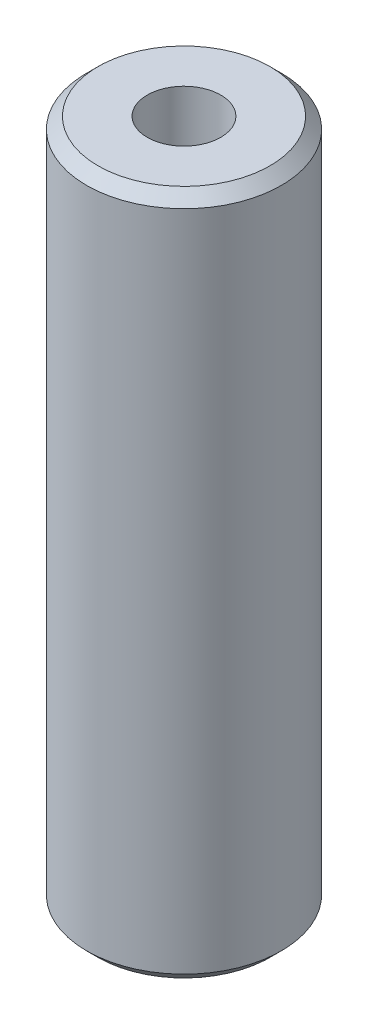
ISO-10303-21;
HEADER;
FILE_DESCRIPTION(('STEP AP214'),'2;1');
FILE_NAME('part.step','',(''),(''),'','','');
FILE_SCHEMA(('AUTOMOTIVE_DESIGN { 1 0 10303 214 1 1 1 1 }'));
ENDSEC;
DATA;
#1=APPLICATION_CONTEXT('core data for automotive mechanical design processes');
#2=APPLICATION_PROTOCOL_DEFINITION('international standard','automotive_design',2000,#1);
#3=PRODUCT_CONTEXT('',#1,'mechanical');
#4=PRODUCT('Part','Part','',(#3));
#5=PRODUCT_RELATED_PRODUCT_CATEGORY('part','',(#4));
#6=PRODUCT_DEFINITION_FORMATION('','',#4);
#7=PRODUCT_DEFINITION_CONTEXT('part definition',#1,'design');
#8=PRODUCT_DEFINITION('design','',#6,#7);
#9=PRODUCT_DEFINITION_SHAPE('','',#8);
#10=(LENGTH_UNIT() NAMED_UNIT(*) SI_UNIT(.MILLI.,.METRE.));
#11=(NAMED_UNIT(*) PLANE_ANGLE_UNIT() SI_UNIT($,.RADIAN.));
#12=(NAMED_UNIT(*) SI_UNIT($,.STERADIAN.) SOLID_ANGLE_UNIT());
#13=UNCERTAINTY_MEASURE_WITH_UNIT(LENGTH_MEASURE(1.E-05),#10,'distance_accuracy_value','');
#14=(GEOMETRIC_REPRESENTATION_CONTEXT(3) GLOBAL_UNCERTAINTY_ASSIGNED_CONTEXT((#13)) GLOBAL_UNIT_ASSIGNED_CONTEXT((#10,
#11,#12)) REPRESENTATION_CONTEXT('',''));
#15=CARTESIAN_POINT('',(0.,0.,0.));
#16=DIRECTION('',(0.,0.,1.));
#17=DIRECTION('',(1.,0.,0.));
#18=AXIS2_PLACEMENT_3D('',#15,#16,#17);
#19=CARTESIAN_POINT('',(0.,88.0417816881623,0.));
#20=DIRECTION('',(0.,-1.,0.));
#21=DIRECTION('',(0.,0.,-1.));
#22=AXIS2_PLACEMENT_3D('',#19,#20,#21);
#23=CYLINDRICAL_SURFACE('',#22,12.5);
#24=CARTESIAN_POINT('',(0.,86.5856637542295,0.));
#25=DIRECTION('',(0.,1.,0.));
#26=DIRECTION('',(0.,0.,1.));
#27=AXIS2_PLACEMENT_3D('',#24,#25,#26);
#28=CIRCLE('',#27,12.5);
#29=CARTESIAN_POINT('',(0.,86.5856637542295,12.5));
#30=VERTEX_POINT('',#29);
#31=EDGE_CURVE('E50',#30,#30,#28,.F.);
#32=ORIENTED_EDGE('',*,*,#31,.T.);
#33=EDGE_LOOP('',(#32));
#34=FACE_BOUND('',#33,.T.);
#35=CARTESIAN_POINT('',(0.,1.45611793393274,0.));
#36=DIRECTION('',(0.,1.,0.));
#37=DIRECTION('',(0.,0.,1.));
#38=AXIS2_PLACEMENT_3D('',#35,#36,#37);
#39=CIRCLE('',#38,12.5);
#40=CARTESIAN_POINT('',(0.,1.45611793393274,12.5));
#41=VERTEX_POINT('',#40);
#42=EDGE_CURVE('E51',#41,#41,#39,.T.);
#43=ORIENTED_EDGE('',*,*,#42,.T.);
#44=EDGE_LOOP('',(#43));
#45=FACE_BOUND('',#44,.T.);
#46=ADVANCED_FACE('F39',(#34,#45),#23,.T.);
#47=CARTESIAN_POINT('',(0.,88.0417816881623,0.));
#48=DIRECTION('',(0.,1.,0.));
#49=DIRECTION('',(0.,0.,1.));
#50=AXIS2_PLACEMENT_3D('',#47,#48,#49);
#51=PLANE('',#50);
#52=CARTESIAN_POINT('',(0.,88.0417816881623,0.));
#53=DIRECTION('',(0.,1.,0.));
#54=DIRECTION('',(0.,0.,1.));
#55=AXIS2_PLACEMENT_3D('',#52,#53,#54);
#56=CIRCLE('',#55,11.0438820660672);
#57=CARTESIAN_POINT('',(0.,88.0417816881623,11.0438820660672));
#58=VERTEX_POINT('',#57);
#59=EDGE_CURVE('E54',#58,#58,#56,.T.);
#60=ORIENTED_EDGE('',*,*,#59,.T.);
#61=EDGE_LOOP('',(#60));
#62=FACE_BOUND('',#61,.T.);
#63=CARTESIAN_POINT('',(0.,88.0417816881623,0.));
#64=DIRECTION('',(0.,1.,0.));
#65=DIRECTION('',(0.,0.,1.));
#66=AXIS2_PLACEMENT_3D('',#63,#64,#65);
#67=CIRCLE('',#66,4.7165349036978);
#68=CARTESIAN_POINT('',(0.,88.0417816881623,4.7165349036978));
#69=VERTEX_POINT('',#68);
#70=EDGE_CURVE('E58',#69,#69,#67,.T.);
#71=ORIENTED_EDGE('',*,*,#70,.F.);
#72=EDGE_LOOP('',(#71));
#73=FACE_BOUND('',#72,.T.);
#74=ADVANCED_FACE('F69',(#62,#73),#51,.T.);
#75=CARTESIAN_POINT('',(0.,0.,0.));
#76=DIRECTION('',(0.,1.,0.));
#77=DIRECTION('',(0.,0.,1.));
#78=AXIS2_PLACEMENT_3D('',#75,#76,#77);
#79=PLANE('',#78);
#80=CARTESIAN_POINT('',(0.,0.,0.));
#81=DIRECTION('',(0.,1.,0.));
#82=DIRECTION('',(0.,0.,1.));
#83=AXIS2_PLACEMENT_3D('',#80,#81,#82);
#84=CIRCLE('',#83,11.0438820660672);
#85=CARTESIAN_POINT('',(0.,0.,11.0438820660672));
#86=VERTEX_POINT('',#85);
#87=EDGE_CURVE('E10',#86,#86,#84,.F.);
#88=ORIENTED_EDGE('',*,*,#87,.T.);
#89=EDGE_LOOP('',(#88));
#90=FACE_BOUND('',#89,.T.);
#91=CARTESIAN_POINT('',(0.,0.,0.));
#92=DIRECTION('',(0.,1.,0.));
#93=DIRECTION('',(0.,0.,1.));
#94=AXIS2_PLACEMENT_3D('',#91,#92,#93);
#95=CIRCLE('',#94,4.7165349036978);
#96=CARTESIAN_POINT('',(0.,0.,4.7165349036978));
#97=VERTEX_POINT('',#96);
#98=EDGE_CURVE('E63',#97,#97,#95,.T.);
#99=ORIENTED_EDGE('',*,*,#98,.T.);
#100=EDGE_LOOP('',(#99));
#101=FACE_BOUND('',#100,.T.);
#102=ADVANCED_FACE('F75',(#90,#101),#79,.F.);
#103=CARTESIAN_POINT('',(0.,88.0417816881623,0.));
#104=DIRECTION('',(0.,-1.,0.));
#105=DIRECTION('',(0.,0.,-1.));
#106=AXIS2_PLACEMENT_3D('',#103,#104,#105);
#107=CYLINDRICAL_SURFACE('',#106,4.7165349036978);
#108=ORIENTED_EDGE('',*,*,#70,.T.);
#109=EDGE_LOOP('',(#108));
#110=FACE_BOUND('',#109,.T.);
#111=ORIENTED_EDGE('',*,*,#98,.F.);
#112=EDGE_LOOP('',(#111));
#113=FACE_BOUND('',#112,.T.);
#114=ADVANCED_FACE('F70',(#110,#113),#107,.F.);
#115=CARTESIAN_POINT('',(0.,88.0417816881623,0.));
#116=DIRECTION('',(0.,-1.,0.));
#117=DIRECTION('',(0.,0.,-1.));
#118=AXIS2_PLACEMENT_3D('',#115,#116,#117);
#119=CONICAL_SURFACE('',#118,11.0438820660672,0.785398163397444);
#120=ORIENTED_EDGE('',*,*,#31,.F.);
#121=EDGE_LOOP('',(#120));
#122=FACE_BOUND('',#121,.T.);
#123=ORIENTED_EDGE('',*,*,#59,.F.);
#124=EDGE_LOOP('',(#123));
#125=FACE_BOUND('',#124,.T.);
#126=ADVANCED_FACE('F81',(#122,#125),#119,.T.);
#127=CARTESIAN_POINT('',(0.,1.45611793393274,0.));
#128=DIRECTION('',(0.,1.,0.));
#129=DIRECTION('',(0.,0.,1.));
#130=AXIS2_PLACEMENT_3D('',#127,#128,#129);
#131=CONICAL_SURFACE('',#130,12.5,0.785398163397451);
#132=CARTESIAN_POINT('',(0.,0.,11.0438820660672));
#133=CARTESIAN_POINT('',(0.,0.0151678951451325,11.0590499612124));
#134=CARTESIAN_POINT('',(0.,0.0303357902902653,11.0742178563575));
#135=CARTESIAN_POINT('',(0.,0.0606715805805308,11.1045536466478));
#136=CARTESIAN_POINT('',(0.,0.0758394757256635,11.1197215417929));
#137=CARTESIAN_POINT('',(0.,0.106175266015929,11.1500573320832));
#138=CARTESIAN_POINT('',(0.,0.121343161161062,11.1652252272283));
#139=CARTESIAN_POINT('',(0.,0.151678951451327,11.1955610175186));
#140=CARTESIAN_POINT('',(0.,0.16684684659646,11.2107289126637));
#141=CARTESIAN_POINT('',(0.,0.197182636886726,11.241064702954));
#142=CARTESIAN_POINT('',(0.,0.212350532031858,11.2562325980991));
#143=CARTESIAN_POINT('',(0.,0.242686322322124,11.2865683883894));
#144=CARTESIAN_POINT('',(0.,0.257854217467256,11.3017362835345));
#145=CARTESIAN_POINT('',(0.,0.288190007757522,11.3320720738248));
#146=CARTESIAN_POINT('',(0.,0.303357902902655,11.3472399689699));
#147=CARTESIAN_POINT('',(0.,0.33369369319292,11.3775757592602));
#148=CARTESIAN_POINT('',(0.,0.348861588338053,11.3927436544053));
#149=CARTESIAN_POINT('',(0.,0.379197378628318,11.4230794446956));
#150=CARTESIAN_POINT('',(0.,0.394365273773451,11.4382473398407));
#151=CARTESIAN_POINT('',(0.,0.424701064063717,11.468583130131));
#152=CARTESIAN_POINT('',(0.,0.439868959208849,11.4837510252761));
#153=CARTESIAN_POINT('',(0.,0.470204749499115,11.5140868155664));
#154=CARTESIAN_POINT('',(0.,0.485372644644248,11.5292547107115));
#155=CARTESIAN_POINT('',(0.,0.515708434934513,11.5595905010018));
#156=CARTESIAN_POINT('',(0.,0.530876330079646,11.5747583961469));
#157=CARTESIAN_POINT('',(0.,0.561212120369911,11.6050941864372));
#158=CARTESIAN_POINT('',(0.,0.576380015515044,11.6202620815823));
#159=CARTESIAN_POINT('',(0.,0.60671580580531,11.6505978718726));
#160=CARTESIAN_POINT('',(0.,0.621883700950443,11.6657657670177));
#161=CARTESIAN_POINT('',(0.,0.652219491240708,11.696101557308));
#162=CARTESIAN_POINT('',(0.,0.667387386385841,11.7112694524531));
#163=CARTESIAN_POINT('',(0.,0.697723176676106,11.7416052427434));
#164=CARTESIAN_POINT('',(0.,0.712891071821239,11.7567731378885));
#165=CARTESIAN_POINT('',(0.,0.743226862111504,11.7871089281788));
#166=CARTESIAN_POINT('',(0.,0.758394757256637,11.8022768233239));
#167=CARTESIAN_POINT('',(0.,0.788730547546902,11.8326126136142));
#168=CARTESIAN_POINT('',(0.,0.803898442692035,11.8477805087593));
#169=CARTESIAN_POINT('',(0.,0.834234232982301,11.8781162990496));
#170=CARTESIAN_POINT('',(0.,0.849402128127434,11.8932841941947));
#171=CARTESIAN_POINT('',(0.,0.879737918417699,11.923619984485));
#172=CARTESIAN_POINT('',(0.,0.894905813562832,11.9387878796301));
#173=CARTESIAN_POINT('',(0.,0.925241603853097,11.9691236699204));
#174=CARTESIAN_POINT('',(0.,0.94040949899823,11.9842915650655));
#175=CARTESIAN_POINT('',(0.,0.970745289288496,12.0146273553557));
#176=CARTESIAN_POINT('',(0.,0.985913184433628,12.0297952505009));
#177=CARTESIAN_POINT('',(0.,1.01624897472389,12.0601310407911));
#178=CARTESIAN_POINT('',(0.,1.03141686986903,12.0752989359363));
#179=CARTESIAN_POINT('',(0.,1.06175266015929,12.1056347262265));
#180=CARTESIAN_POINT('',(0.,1.07692055530442,12.1208026213717));
#181=CARTESIAN_POINT('',(0.,1.10725634559469,12.1511384116619));
#182=CARTESIAN_POINT('',(0.,1.12242424073982,12.1663063068071));
#183=CARTESIAN_POINT('',(0.,1.15276003103009,12.1966420970973));
#184=CARTESIAN_POINT('',(0.,1.16792792617522,12.2118099922425));
#185=CARTESIAN_POINT('',(0.,1.19826371646549,12.2421457825327));
#186=CARTESIAN_POINT('',(0.,1.21343161161062,12.2573136776779));
#187=CARTESIAN_POINT('',(0.,1.24376740190089,12.2876494679681));
#188=CARTESIAN_POINT('',(0.,1.25893529704602,12.3028173631133));
#189=CARTESIAN_POINT('',(0.,1.28927108733628,12.3331531534035));
#190=CARTESIAN_POINT('',(0.,1.30443898248142,12.3483210485487));
#191=CARTESIAN_POINT('',(0.,1.33477477277168,12.3786568388389));
#192=CARTESIAN_POINT('',(0.,1.34994266791681,12.3938247339841));
#193=CARTESIAN_POINT('',(0.,1.38027845820708,12.4241605242743));
#194=CARTESIAN_POINT('',(0.,1.39544635335221,12.4393284194195));
#195=CARTESIAN_POINT('',(0.,1.42578214364248,12.4696642097097));
#196=CARTESIAN_POINT('',(0.,1.44095003878761,12.4848321048549));
#197=CARTESIAN_POINT('',(0.,1.45611793393274,12.5));
#198=B_SPLINE_CURVE_WITH_KNOTS('',3,(#132,#133,#134,#135,#136,#137,#138,#139,#140,#141,#142,
#143,#144,#145,#146,#147,#148,#149,#150,#151,#152,#153,#154,#155,#156,#157,#158,#159,#160,#161,
#162,#163,#164,#165,#166,#167,#168,#169,#170,#171,#172,#173,#174,#175,#176,#177,#178,#179,#180,
#181,#182,#183,#184,#185,#186,#187,#188,#189,#190,#191,#192,#193,#194,#195,#196,#197),
.UNSPECIFIED.,.F.,.F.,(4,2,2,2,2,2,2,2,2,2,2,2,2,2,2,2,2,2,2,2,2,2,2,2,2,2,2,2,2,2,2,2,4),(0.,
0.0643519290806993,0.128703858161399,0.193055787242098,0.257407716322797,0.321759645403498,
0.386111574484197,0.450463503564896,0.514815432645595,0.579167361726295,0.643519290806994,
0.707871219887693,0.772223148968394,0.836575078049093,0.900927007129792,0.965278936210491,
1.02963086529119,1.09398279437189,1.15833472345259,1.22268665253329,1.28703858161399,
1.35139051069469,1.41574243977539,1.48009436885609,1.54444629793679,1.60879822701749,
1.67315015609819,1.73750208517889,1.80185401425958,1.86620594334029,1.93055787242098,
1.99490980150168,2.05926173058238),.UNSPECIFIED.);
#199=EDGE_CURVE('BSEAM45',#86,#41,#198,.T.);
#200=ORIENTED_EDGE('',*,*,#87,.F.);
#201=ORIENTED_EDGE('',*,*,#42,.F.);
#202=ORIENTED_EDGE('',*,*,#199,.T.);
#203=ORIENTED_EDGE('',*,*,#199,.F.);
#204=EDGE_LOOP('',(#200,#202,#201,#203));
#205=FACE_BOUND('',#204,.T.);
#206=ADVANCED_FACE('F45',(#205),#131,.T.);
#207=CLOSED_SHELL('',(#46,#74,#102,#114,#126,#206));
#208=MANIFOLD_SOLID_BREP('B2',#207);
#209=ADVANCED_BREP_SHAPE_REPRESENTATION('',(#18,#208),#14);
#210=SHAPE_DEFINITION_REPRESENTATION(#9,#209);
ENDSEC;
END-ISO-10303-21;
